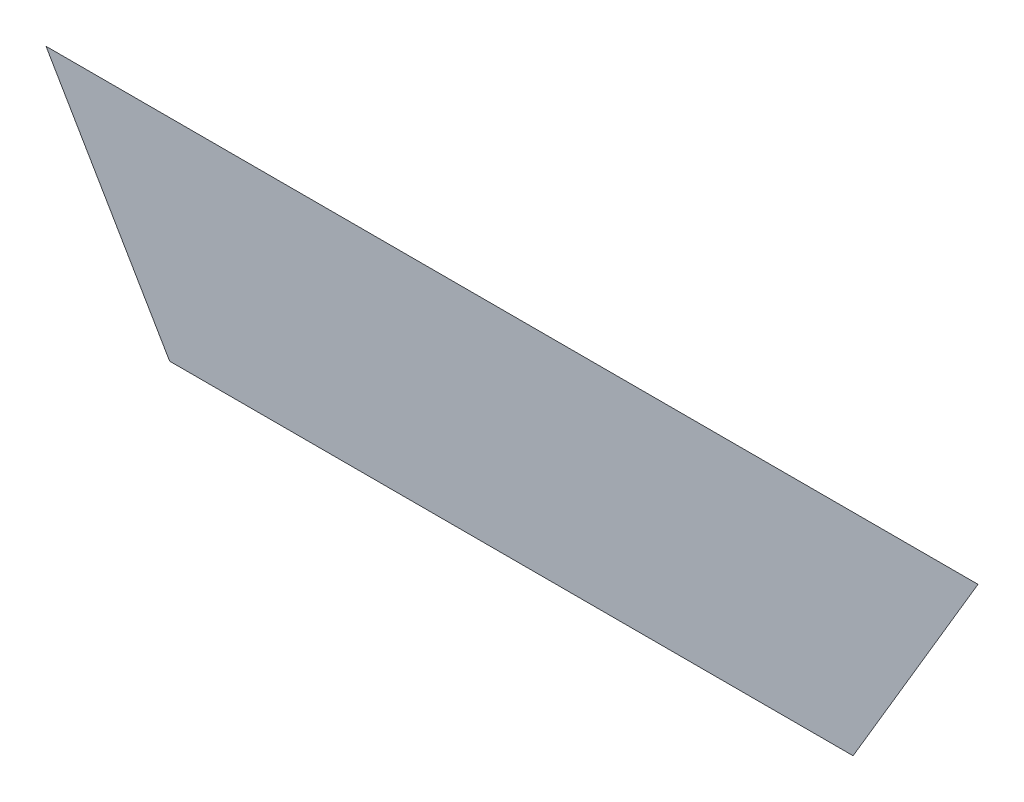
ISO-10303-21;
HEADER;
FILE_DESCRIPTION(('STEP AP214'),'2;1');
FILE_NAME('part.step','',(''),(''),'','','');
FILE_SCHEMA(('AUTOMOTIVE_DESIGN { 1 0 10303 214 1 1 1 1 }'));
ENDSEC;
DATA;
#1=APPLICATION_CONTEXT('core data for automotive mechanical design processes');
#2=APPLICATION_PROTOCOL_DEFINITION('international standard','automotive_design',2000,#1);
#3=PRODUCT_CONTEXT('',#1,'mechanical');
#4=PRODUCT('Part','Part','',(#3));
#5=PRODUCT_RELATED_PRODUCT_CATEGORY('part','',(#4));
#6=PRODUCT_DEFINITION_FORMATION('','',#4);
#7=PRODUCT_DEFINITION_CONTEXT('part definition',#1,'design');
#8=PRODUCT_DEFINITION('design','',#6,#7);
#9=PRODUCT_DEFINITION_SHAPE('','',#8);
#10=(LENGTH_UNIT() NAMED_UNIT(*) SI_UNIT(.MILLI.,.METRE.));
#11=(NAMED_UNIT(*) PLANE_ANGLE_UNIT() SI_UNIT($,.RADIAN.));
#12=(NAMED_UNIT(*) SI_UNIT($,.STERADIAN.) SOLID_ANGLE_UNIT());
#13=UNCERTAINTY_MEASURE_WITH_UNIT(LENGTH_MEASURE(1.E-05),#10,'distance_accuracy_value','');
#14=(GEOMETRIC_REPRESENTATION_CONTEXT(3) GLOBAL_UNCERTAINTY_ASSIGNED_CONTEXT((#13)) GLOBAL_UNIT_ASSIGNED_CONTEXT((#10,
#11,#12)) REPRESENTATION_CONTEXT('',''));
#15=CARTESIAN_POINT('',(0.,0.,0.));
#16=DIRECTION('',(0.,0.,1.));
#17=DIRECTION('',(1.,0.,0.));
#18=AXIS2_PLACEMENT_3D('',#15,#16,#17);
#19=CARTESIAN_POINT('',(-0.045141828774,0.929781889314,0.00015));
#20=DIRECTION('',(0.,0.,1.));
#21=DIRECTION('',(1.,0.,0.));
#22=AXIS2_PLACEMENT_3D('',#19,#20,#21);
#23=PLANE('',#22);
#24=CARTESIAN_POINT('',(0.00841209108435,0.929781889314,0.00015));
#25=DIRECTION('',(0.509570899856073,0.860428671081963,0.));
#26=VECTOR('',#25,1.);
#27=LINE('',#24,#26);
#28=CARTESIAN_POINT('',(0.00841209108435,0.929781889314,7.5E-05));
#29=VERTEX_POINT('',#28);
#30=CARTESIAN_POINT('',(0.02802447248435,0.962898096047,7.5E-05));
#31=VERTEX_POINT('',#30);
#32=EDGE_CURVE('E41',#29,#31,#27,.T.);
#33=ORIENTED_EDGE('',*,*,#32,.T.);
#34=CARTESIAN_POINT('',(0.02802447248435,0.962898096047,0.00015));
#35=DIRECTION('',(-1.,0.,0.));
#36=VECTOR('',#35,1.);
#37=LINE('',#34,#36);
#38=CARTESIAN_POINT('',(-0.118308130032,0.962898096047,7.5E-05));
#39=VERTEX_POINT('',#38);
#40=EDGE_CURVE('E28',#31,#39,#37,.T.);
#41=ORIENTED_EDGE('',*,*,#40,.T.);
#42=CARTESIAN_POINT('',(-0.118308130032,0.962898096047,0.00015));
#43=DIRECTION('',(0.505626052509369,-0.86275274269271,0.));
#44=VECTOR('',#43,1.);
#45=LINE('',#42,#44);
#46=CARTESIAN_POINT('',(-0.09890000061565,0.929781889314,7.5E-05));
#47=VERTEX_POINT('',#46);
#48=EDGE_CURVE('E11',#39,#47,#45,.T.);
#49=ORIENTED_EDGE('',*,*,#48,.T.);
#50=CARTESIAN_POINT('',(-0.09890000061565,0.929781889314,0.00015));
#51=DIRECTION('',(1.,0.,0.));
#52=VECTOR('',#51,1.);
#53=LINE('',#50,#52);
#54=EDGE_CURVE('E44',#47,#29,#53,.T.);
#55=ORIENTED_EDGE('',*,*,#54,.T.);
#56=EDGE_LOOP('',(#33,#41,#49,#55));
#57=FACE_BOUND('',#56,.T.);
#58=ADVANCED_FACE('F17',(#57),#23,.T.);
#59=CARTESIAN_POINT('',(-0.045141828774,0.929781889314,0.));
#60=DIRECTION('',(0.,0.,1.));
#61=DIRECTION('',(1.,0.,0.));
#62=AXIS2_PLACEMENT_3D('',#59,#60,#61);
#63=PLANE('',#62);
#64=ORIENTED_EDGE('',*,*,#40,.F.);
#65=ORIENTED_EDGE('',*,*,#32,.F.);
#66=ORIENTED_EDGE('',*,*,#54,.F.);
#67=ORIENTED_EDGE('',*,*,#48,.F.);
#68=EDGE_LOOP('',(#64,#65,#66,#67));
#69=FACE_BOUND('',#68,.T.);
#70=ADVANCED_FACE('F46',(#69),#63,.F.);
#71=CLOSED_SHELL('',(#58,#70));
#72=MANIFOLD_SOLID_BREP('B1',#71);
#73=ADVANCED_BREP_SHAPE_REPRESENTATION('',(#18,#72),#14);
#74=SHAPE_DEFINITION_REPRESENTATION(#9,#73);
ENDSEC;
END-ISO-10303-21;
